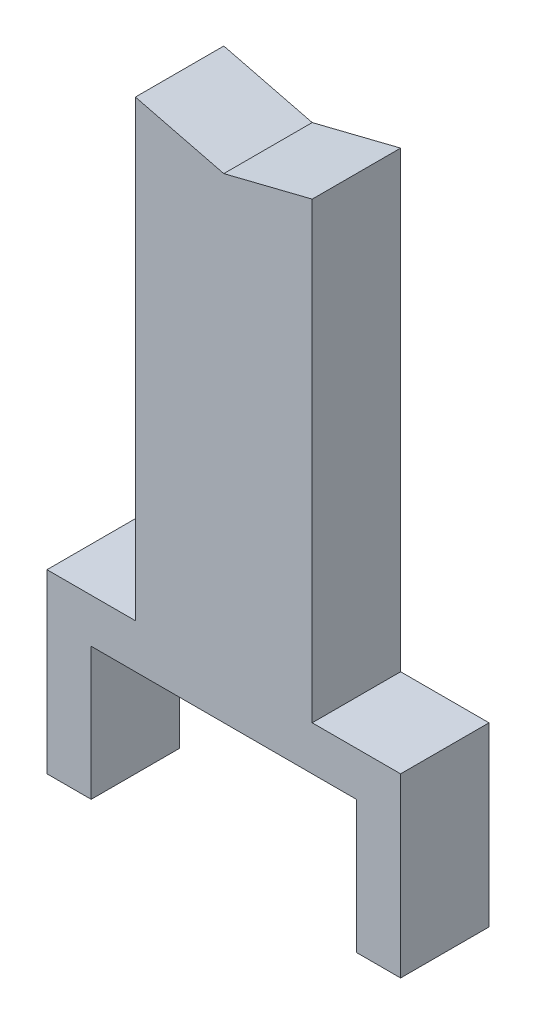
ISO-10303-21;
HEADER;
FILE_DESCRIPTION(('STEP AP214'),'2;1');
FILE_NAME('part.step','',(''),(''),'','','');
FILE_SCHEMA(('AUTOMOTIVE_DESIGN { 1 0 10303 214 1 1 1 1 }'));
ENDSEC;
DATA;
#1=APPLICATION_CONTEXT('core data for automotive mechanical design processes');
#2=APPLICATION_PROTOCOL_DEFINITION('international standard','automotive_design',2000,#1);
#3=PRODUCT_CONTEXT('',#1,'mechanical');
#4=PRODUCT('Part','Part','',(#3));
#5=PRODUCT_RELATED_PRODUCT_CATEGORY('part','',(#4));
#6=PRODUCT_DEFINITION_FORMATION('','',#4);
#7=PRODUCT_DEFINITION_CONTEXT('part definition',#1,'design');
#8=PRODUCT_DEFINITION('design','',#6,#7);
#9=PRODUCT_DEFINITION_SHAPE('','',#8);
#10=(LENGTH_UNIT() NAMED_UNIT(*) SI_UNIT(.MILLI.,.METRE.));
#11=(NAMED_UNIT(*) PLANE_ANGLE_UNIT() SI_UNIT($,.RADIAN.));
#12=(NAMED_UNIT(*) SI_UNIT($,.STERADIAN.) SOLID_ANGLE_UNIT());
#13=UNCERTAINTY_MEASURE_WITH_UNIT(LENGTH_MEASURE(1.E-05),#10,'distance_accuracy_value','');
#14=(GEOMETRIC_REPRESENTATION_CONTEXT(3) GLOBAL_UNCERTAINTY_ASSIGNED_CONTEXT((#13)) GLOBAL_UNIT_ASSIGNED_CONTEXT((#10,
#11,#12)) REPRESENTATION_CONTEXT('',''));
#15=CARTESIAN_POINT('',(0.,0.,0.));
#16=DIRECTION('',(0.,0.,1.));
#17=DIRECTION('',(1.,0.,0.));
#18=AXIS2_PLACEMENT_3D('',#15,#16,#17);
#19=CARTESIAN_POINT('',(0.,76.2,25.4));
#20=DIRECTION('',(0.,1.,0.));
#21=DIRECTION('',(-1.,0.,0.));
#22=AXIS2_PLACEMENT_3D('',#19,#20,#21);
#23=PLANE('',#22);
#24=DIRECTION('',(1.,0.,0.));
#25=VECTOR('',#24,1.);
#26=CARTESIAN_POINT('',(0.,76.2,-25.4));
#27=LINE('',#26,#25);
#28=CARTESIAN_POINT('',(-76.1999999999999,76.2,-25.4));
#29=VERTEX_POINT('',#28);
#30=CARTESIAN_POINT('',(76.2,76.2,-25.4));
#31=VERTEX_POINT('',#30);
#32=EDGE_CURVE('E174',#29,#31,#27,.T.);
#33=ORIENTED_EDGE('',*,*,#32,.T.);
#34=DIRECTION('',(0.,0.,-1.));
#35=VECTOR('',#34,1.);
#36=CARTESIAN_POINT('',(76.2,76.2,25.4));
#37=LINE('',#36,#35);
#38=CARTESIAN_POINT('',(76.2,76.2,25.4));
#39=VERTEX_POINT('',#38);
#40=EDGE_CURVE('E11',#39,#31,#37,.T.);
#41=ORIENTED_EDGE('',*,*,#40,.F.);
#42=DIRECTION('',(1.,0.,0.));
#43=VECTOR('',#42,1.);
#44=CARTESIAN_POINT('',(0.,76.2,25.4));
#45=LINE('',#44,#43);
#46=CARTESIAN_POINT('',(-76.1999999999999,76.2,25.4));
#47=VERTEX_POINT('',#46);
#48=EDGE_CURVE('E113',#47,#39,#45,.T.);
#49=ORIENTED_EDGE('',*,*,#48,.F.);
#50=DIRECTION('',(0.,0.,-1.));
#51=VECTOR('',#50,1.);
#52=CARTESIAN_POINT('',(-76.1999999999999,76.2,25.4));
#53=LINE('',#52,#51);
#54=EDGE_CURVE('E170',#47,#29,#53,.T.);
#55=ORIENTED_EDGE('',*,*,#54,.T.);
#56=EDGE_LOOP('',(#33,#41,#49,#55));
#57=FACE_BOUND('',#56,.T.);
#58=ADVANCED_FACE('F45',(#57),#23,.F.);
#59=CARTESIAN_POINT('',(76.2,0.,25.4));
#60=DIRECTION('',(-1.,0.,0.));
#61=DIRECTION('',(0.,-1.,0.));
#62=AXIS2_PLACEMENT_3D('',#59,#60,#61);
#63=PLANE('',#62);
#64=DIRECTION('',(0.,1.,0.));
#65=VECTOR('',#64,1.);
#66=CARTESIAN_POINT('',(76.2,0.,-25.4));
#67=LINE('',#66,#65);
#68=CARTESIAN_POINT('',(76.2,0.,-25.4));
#69=VERTEX_POINT('',#68);
#70=EDGE_CURVE('E178',#69,#31,#67,.T.);
#71=ORIENTED_EDGE('',*,*,#70,.F.);
#72=DIRECTION('',(0.,0.,-1.));
#73=VECTOR('',#72,1.);
#74=CARTESIAN_POINT('',(76.2,0.,25.4));
#75=LINE('',#74,#73);
#76=CARTESIAN_POINT('',(76.2,0.,25.4));
#77=VERTEX_POINT('',#76);
#78=EDGE_CURVE('E54',#77,#69,#75,.T.);
#79=ORIENTED_EDGE('',*,*,#78,.F.);
#80=DIRECTION('',(0.,1.,0.));
#81=VECTOR('',#80,1.);
#82=CARTESIAN_POINT('',(76.2,0.,25.4));
#83=LINE('',#82,#81);
#84=EDGE_CURVE('E263',#77,#39,#83,.T.);
#85=ORIENTED_EDGE('',*,*,#84,.T.);
#86=ORIENTED_EDGE('',*,*,#40,.T.);
#87=EDGE_LOOP('',(#71,#79,#85,#86));
#88=FACE_BOUND('',#87,.T.);
#89=ADVANCED_FACE('F262',(#88),#63,.T.);
#90=CARTESIAN_POINT('',(0.,0.,25.4));
#91=DIRECTION('',(0.,1.,0.));
#92=DIRECTION('',(-1.,0.,0.));
#93=AXIS2_PLACEMENT_3D('',#90,#91,#92);
#94=PLANE('',#93);
#95=DIRECTION('',(1.,0.,0.));
#96=VECTOR('',#95,1.);
#97=CARTESIAN_POINT('',(0.,0.,-25.4));
#98=LINE('',#97,#96);
#99=CARTESIAN_POINT('',(101.6,0.,-25.4));
#100=VERTEX_POINT('',#99);
#101=EDGE_CURVE('E182',#69,#100,#98,.T.);
#102=ORIENTED_EDGE('',*,*,#101,.T.);
#103=DIRECTION('',(0.,0.,-1.));
#104=VECTOR('',#103,1.);
#105=CARTESIAN_POINT('',(101.6,0.,25.4));
#106=LINE('',#105,#104);
#107=CARTESIAN_POINT('',(101.6,0.,25.4));
#108=VERTEX_POINT('',#107);
#109=EDGE_CURVE('E244',#108,#100,#106,.T.);
#110=ORIENTED_EDGE('',*,*,#109,.F.);
#111=DIRECTION('',(1.,0.,0.));
#112=VECTOR('',#111,1.);
#113=CARTESIAN_POINT('',(0.,0.,25.4));
#114=LINE('',#113,#112);
#115=EDGE_CURVE('E253',#77,#108,#114,.T.);
#116=ORIENTED_EDGE('',*,*,#115,.F.);
#117=ORIENTED_EDGE('',*,*,#78,.T.);
#118=EDGE_LOOP('',(#102,#110,#116,#117));
#119=FACE_BOUND('',#118,.T.);
#120=ADVANCED_FACE('F251',(#119),#94,.F.);
#121=CARTESIAN_POINT('',(101.6,0.,25.4));
#122=DIRECTION('',(-1.,0.,0.));
#123=DIRECTION('',(0.,-1.,0.));
#124=AXIS2_PLACEMENT_3D('',#121,#122,#123);
#125=PLANE('',#124);
#126=DIRECTION('',(0.,1.,0.));
#127=VECTOR('',#126,1.);
#128=CARTESIAN_POINT('',(101.6,0.,-25.4));
#129=LINE('',#128,#127);
#130=CARTESIAN_POINT('',(101.6,101.6,-25.4));
#131=VERTEX_POINT('',#130);
#132=EDGE_CURVE('E185',#100,#131,#129,.T.);
#133=ORIENTED_EDGE('',*,*,#132,.T.);
#134=DIRECTION('',(0.,0.,-1.));
#135=VECTOR('',#134,1.);
#136=CARTESIAN_POINT('',(101.6,101.6,25.4));
#137=LINE('',#136,#135);
#138=CARTESIAN_POINT('',(101.6,101.6,25.4));
#139=VERTEX_POINT('',#138);
#140=EDGE_CURVE('E240',#139,#131,#137,.T.);
#141=ORIENTED_EDGE('',*,*,#140,.F.);
#142=DIRECTION('',(0.,1.,0.));
#143=VECTOR('',#142,1.);
#144=CARTESIAN_POINT('',(101.6,0.,25.4));
#145=LINE('',#144,#143);
#146=EDGE_CURVE('E299',#108,#139,#145,.T.);
#147=ORIENTED_EDGE('',*,*,#146,.F.);
#148=ORIENTED_EDGE('',*,*,#109,.T.);
#149=EDGE_LOOP('',(#133,#141,#147,#148));
#150=FACE_BOUND('',#149,.T.);
#151=ADVANCED_FACE('F298',(#150),#125,.F.);
#152=CARTESIAN_POINT('',(3.88578058618806E-13,101.6,25.4));
#153=DIRECTION('',(0.,-1.,0.));
#154=DIRECTION('',(1.,0.,0.));
#155=AXIS2_PLACEMENT_3D('',#152,#153,#154);
#156=PLANE('',#155);
#157=DIRECTION('',(-1.,0.,0.));
#158=VECTOR('',#157,1.);
#159=CARTESIAN_POINT('',(3.88578058618806E-13,101.6,-25.4));
#160=LINE('',#159,#158);
#161=CARTESIAN_POINT('',(50.7999999999999,101.6,-25.4));
#162=VERTEX_POINT('',#161);
#163=EDGE_CURVE('E188',#131,#162,#160,.T.);
#164=ORIENTED_EDGE('',*,*,#163,.T.);
#165=DIRECTION('',(0.,0.,-1.));
#166=VECTOR('',#165,1.);
#167=CARTESIAN_POINT('',(50.7999999999999,101.6,25.4));
#168=LINE('',#167,#166);
#169=CARTESIAN_POINT('',(50.7999999999999,101.6,25.4));
#170=VERTEX_POINT('',#169);
#171=EDGE_CURVE('E236',#170,#162,#168,.T.);
#172=ORIENTED_EDGE('',*,*,#171,.F.);
#173=DIRECTION('',(-1.,0.,0.));
#174=VECTOR('',#173,1.);
#175=CARTESIAN_POINT('',(3.88578058618806E-13,101.6,25.4));
#176=LINE('',#175,#174);
#177=EDGE_CURVE('E294',#139,#170,#176,.T.);
#178=ORIENTED_EDGE('',*,*,#177,.F.);
#179=ORIENTED_EDGE('',*,*,#140,.T.);
#180=EDGE_LOOP('',(#164,#172,#178,#179));
#181=FACE_BOUND('',#180,.T.);
#182=ADVANCED_FACE('F293',(#181),#156,.F.);
#183=CARTESIAN_POINT('',(50.7999999999999,0.,25.4));
#184=DIRECTION('',(-1.,0.,0.));
#185=DIRECTION('',(0.,-1.,0.));
#186=AXIS2_PLACEMENT_3D('',#183,#184,#185);
#187=PLANE('',#186);
#188=DIRECTION('',(0.,1.,0.));
#189=VECTOR('',#188,1.);
#190=CARTESIAN_POINT('',(50.7999999999999,0.,-25.4));
#191=LINE('',#190,#189);
#192=CARTESIAN_POINT('',(50.8,362.204,-25.4));
#193=VERTEX_POINT('',#192);
#194=EDGE_CURVE('E191',#162,#193,#191,.T.);
#195=ORIENTED_EDGE('',*,*,#194,.T.);
#196=DIRECTION('',(0.,0.,-1.));
#197=VECTOR('',#196,1.);
#198=CARTESIAN_POINT('',(50.8,362.204,25.4));
#199=LINE('',#198,#197);
#200=CARTESIAN_POINT('',(50.8,362.204,25.4));
#201=VERTEX_POINT('',#200);
#202=EDGE_CURVE('E233',#201,#193,#199,.T.);
#203=ORIENTED_EDGE('',*,*,#202,.F.);
#204=DIRECTION('',(0.,1.,0.));
#205=VECTOR('',#204,1.);
#206=CARTESIAN_POINT('',(50.7999999999999,0.,25.4));
#207=LINE('',#206,#205);
#208=EDGE_CURVE('E290',#170,#201,#207,.T.);
#209=ORIENTED_EDGE('',*,*,#208,.F.);
#210=ORIENTED_EDGE('',*,*,#171,.T.);
#211=EDGE_LOOP('',(#195,#203,#209,#210));
#212=FACE_BOUND('',#211,.T.);
#213=ADVANCED_FACE('F288',(#212),#187,.F.);
#214=CARTESIAN_POINT('',(-82.2362352941176,328.944941176471,25.4));
#215=DIRECTION('',(-0.242535625036333,0.970142500145332,0.));
#216=DIRECTION('',(-0.970142500145332,-0.242535625036333,0.));
#217=AXIS2_PLACEMENT_3D('',#214,#215,#216);
#218=PLANE('',#217);
#219=DIRECTION('',(0.970142500145332,0.242535625036333,0.));
#220=VECTOR('',#219,1.);
#221=CARTESIAN_POINT('',(-82.2362352941176,328.944941176471,-25.4));
#222=LINE('',#221,#220);
#223=CARTESIAN_POINT('',(0.,349.504,-25.4));
#224=VERTEX_POINT('',#223);
#225=EDGE_CURVE('E195',#224,#193,#222,.T.);
#226=ORIENTED_EDGE('',*,*,#225,.F.);
#227=DIRECTION('',(0.,0.,-1.));
#228=VECTOR('',#227,1.);
#229=CARTESIAN_POINT('',(0.,349.504,25.4));
#230=LINE('',#229,#228);
#231=CARTESIAN_POINT('',(0.,349.504,25.4));
#232=VERTEX_POINT('',#231);
#233=EDGE_CURVE('E230',#232,#224,#230,.T.);
#234=ORIENTED_EDGE('',*,*,#233,.F.);
#235=DIRECTION('',(0.970142500145332,0.242535625036333,0.));
#236=VECTOR('',#235,1.);
#237=CARTESIAN_POINT('',(-82.2362352941176,328.944941176471,25.4));
#238=LINE('',#237,#236);
#239=EDGE_CURVE('E285',#232,#201,#238,.T.);
#240=ORIENTED_EDGE('',*,*,#239,.T.);
#241=ORIENTED_EDGE('',*,*,#202,.T.);
#242=EDGE_LOOP('',(#226,#234,#240,#241));
#243=FACE_BOUND('',#242,.T.);
#244=ADVANCED_FACE('F281',(#243),#218,.T.);
#245=CARTESIAN_POINT('',(82.2362352941176,328.944941176471,25.4));
#246=DIRECTION('',(0.242535625036333,0.970142500145332,0.));
#247=DIRECTION('',(-0.970142500145332,0.242535625036333,0.));
#248=AXIS2_PLACEMENT_3D('',#245,#246,#247);
#249=PLANE('',#248);
#250=DIRECTION('',(0.970142500145332,-0.242535625036333,0.));
#251=VECTOR('',#250,1.);
#252=CARTESIAN_POINT('',(82.2362352941176,328.944941176471,-25.4));
#253=LINE('',#252,#251);
#254=CARTESIAN_POINT('',(-50.8,362.204,-25.4));
#255=VERTEX_POINT('',#254);
#256=EDGE_CURVE('E199',#255,#224,#253,.T.);
#257=ORIENTED_EDGE('',*,*,#256,.F.);
#258=DIRECTION('',(0.,0.,-1.));
#259=VECTOR('',#258,1.);
#260=CARTESIAN_POINT('',(-50.8,362.204,25.4));
#261=LINE('',#260,#259);
#262=CARTESIAN_POINT('',(-50.8,362.204,25.4));
#263=VERTEX_POINT('',#262);
#264=EDGE_CURVE('E227',#263,#255,#261,.T.);
#265=ORIENTED_EDGE('',*,*,#264,.F.);
#266=DIRECTION('',(0.970142500145332,-0.242535625036333,0.));
#267=VECTOR('',#266,1.);
#268=CARTESIAN_POINT('',(82.2362352941176,328.944941176471,25.4));
#269=LINE('',#268,#267);
#270=EDGE_CURVE('E312',#263,#232,#269,.T.);
#271=ORIENTED_EDGE('',*,*,#270,.T.);
#272=ORIENTED_EDGE('',*,*,#233,.T.);
#273=EDGE_LOOP('',(#257,#265,#271,#272));
#274=FACE_BOUND('',#273,.T.);
#275=ADVANCED_FACE('F277',(#274),#249,.T.);
#276=CARTESIAN_POINT('',(-50.7999999999999,0.,25.4));
#277=DIRECTION('',(-1.,0.,0.));
#278=DIRECTION('',(0.,-1.,0.));
#279=AXIS2_PLACEMENT_3D('',#276,#277,#278);
#280=PLANE('',#279);
#281=DIRECTION('',(0.,1.,0.));
#282=VECTOR('',#281,1.);
#283=CARTESIAN_POINT('',(-50.7999999999999,0.,-25.4));
#284=LINE('',#283,#282);
#285=CARTESIAN_POINT('',(-50.7999999999999,101.6,-25.4));
#286=VERTEX_POINT('',#285);
#287=EDGE_CURVE('E203',#286,#255,#284,.T.);
#288=ORIENTED_EDGE('',*,*,#287,.F.);
#289=DIRECTION('',(0.,0.,-1.));
#290=VECTOR('',#289,1.);
#291=CARTESIAN_POINT('',(-50.7999999999999,101.6,25.4));
#292=LINE('',#291,#290);
#293=CARTESIAN_POINT('',(-50.7999999999999,101.6,25.4));
#294=VERTEX_POINT('',#293);
#295=EDGE_CURVE('E224',#294,#286,#292,.T.);
#296=ORIENTED_EDGE('',*,*,#295,.F.);
#297=DIRECTION('',(0.,1.,0.));
#298=VECTOR('',#297,1.);
#299=CARTESIAN_POINT('',(-50.7999999999999,0.,25.4));
#300=LINE('',#299,#298);
#301=EDGE_CURVE('E273',#294,#263,#300,.T.);
#302=ORIENTED_EDGE('',*,*,#301,.T.);
#303=ORIENTED_EDGE('',*,*,#264,.T.);
#304=EDGE_LOOP('',(#288,#296,#302,#303));
#305=FACE_BOUND('',#304,.T.);
#306=ADVANCED_FACE('F271',(#305),#280,.T.);
#307=CARTESIAN_POINT('',(0.,101.6,25.4));
#308=DIRECTION('',(0.,1.,0.));
#309=DIRECTION('',(0.,0.,1.));
#310=AXIS2_PLACEMENT_3D('',#307,#308,#309);
#311=PLANE('',#310);
#312=DIRECTION('',(1.,0.,0.));
#313=VECTOR('',#312,1.);
#314=CARTESIAN_POINT('',(0.,101.6,-25.4));
#315=LINE('',#314,#313);
#316=CARTESIAN_POINT('',(-101.6,101.6,-25.4));
#317=VERTEX_POINT('',#316);
#318=EDGE_CURVE('E207',#317,#286,#315,.T.);
#319=ORIENTED_EDGE('',*,*,#318,.F.);
#320=DIRECTION('',(0.,0.,-1.));
#321=VECTOR('',#320,1.);
#322=CARTESIAN_POINT('',(-101.6,101.6,25.4));
#323=LINE('',#322,#321);
#324=CARTESIAN_POINT('',(-101.6,101.6,25.4));
#325=VERTEX_POINT('',#324);
#326=EDGE_CURVE('E156',#325,#317,#323,.T.);
#327=ORIENTED_EDGE('',*,*,#326,.F.);
#328=DIRECTION('',(1.,0.,0.));
#329=VECTOR('',#328,1.);
#330=CARTESIAN_POINT('',(0.,101.6,25.4));
#331=LINE('',#330,#329);
#332=EDGE_CURVE('E163',#325,#294,#331,.T.);
#333=ORIENTED_EDGE('',*,*,#332,.T.);
#334=ORIENTED_EDGE('',*,*,#295,.T.);
#335=EDGE_LOOP('',(#319,#327,#333,#334));
#336=FACE_BOUND('',#335,.T.);
#337=ADVANCED_FACE('F268',(#336),#311,.T.);
#338=CARTESIAN_POINT('',(-101.6,0.,25.4));
#339=DIRECTION('',(-1.,0.,0.));
#340=DIRECTION('',(0.,0.,1.));
#341=AXIS2_PLACEMENT_3D('',#338,#339,#340);
#342=PLANE('',#341);
#343=DIRECTION('',(0.,1.,0.));
#344=VECTOR('',#343,1.);
#345=CARTESIAN_POINT('',(-101.6,0.,-25.4));
#346=LINE('',#345,#344);
#347=CARTESIAN_POINT('',(-101.6,0.,-25.4));
#348=VERTEX_POINT('',#347);
#349=EDGE_CURVE('E150',#348,#317,#346,.T.);
#350=ORIENTED_EDGE('',*,*,#349,.F.);
#351=DIRECTION('',(0.,0.,-1.));
#352=VECTOR('',#351,1.);
#353=CARTESIAN_POINT('',(-101.6,0.,25.4));
#354=LINE('',#353,#352);
#355=CARTESIAN_POINT('',(-101.6,0.,25.4));
#356=VERTEX_POINT('',#355);
#357=EDGE_CURVE('E145',#356,#348,#354,.T.);
#358=ORIENTED_EDGE('',*,*,#357,.F.);
#359=DIRECTION('',(0.,1.,0.));
#360=VECTOR('',#359,1.);
#361=CARTESIAN_POINT('',(-101.6,0.,25.4));
#362=LINE('',#361,#360);
#363=EDGE_CURVE('E148',#356,#325,#362,.T.);
#364=ORIENTED_EDGE('',*,*,#363,.T.);
#365=ORIENTED_EDGE('',*,*,#326,.T.);
#366=EDGE_LOOP('',(#350,#358,#364,#365));
#367=FACE_BOUND('',#366,.T.);
#368=ADVANCED_FACE('F147',(#367),#342,.T.);
#369=CARTESIAN_POINT('',(0.,0.,25.4));
#370=DIRECTION('',(0.,-1.,0.));
#371=DIRECTION('',(1.,0.,0.));
#372=AXIS2_PLACEMENT_3D('',#369,#370,#371);
#373=PLANE('',#372);
#374=DIRECTION('',(-1.,0.,0.));
#375=VECTOR('',#374,1.);
#376=CARTESIAN_POINT('',(0.,0.,-25.4));
#377=LINE('',#376,#375);
#378=CARTESIAN_POINT('',(-76.1999999999999,0.,-25.4));
#379=VERTEX_POINT('',#378);
#380=EDGE_CURVE('E213',#379,#348,#377,.T.);
#381=ORIENTED_EDGE('',*,*,#380,.F.);
#382=DIRECTION('',(0.,0.,-1.));
#383=VECTOR('',#382,1.);
#384=CARTESIAN_POINT('',(-76.1999999999999,0.,25.4));
#385=LINE('',#384,#383);
#386=CARTESIAN_POINT('',(-76.1999999999999,0.,25.4));
#387=VERTEX_POINT('',#386);
#388=EDGE_CURVE('E104',#387,#379,#385,.T.);
#389=ORIENTED_EDGE('',*,*,#388,.F.);
#390=DIRECTION('',(-1.,0.,0.));
#391=VECTOR('',#390,1.);
#392=CARTESIAN_POINT('',(0.,0.,25.4));
#393=LINE('',#392,#391);
#394=EDGE_CURVE('E160',#387,#356,#393,.T.);
#395=ORIENTED_EDGE('',*,*,#394,.T.);
#396=ORIENTED_EDGE('',*,*,#357,.T.);
#397=EDGE_LOOP('',(#381,#389,#395,#396));
#398=FACE_BOUND('',#397,.T.);
#399=ADVANCED_FACE('F166',(#398),#373,.T.);
#400=CARTESIAN_POINT('',(-76.1999999999999,0.,25.4));
#401=DIRECTION('',(-1.,0.,0.));
#402=DIRECTION('',(0.,-1.,0.));
#403=AXIS2_PLACEMENT_3D('',#400,#401,#402);
#404=PLANE('',#403);
#405=DIRECTION('',(0.,1.,0.));
#406=VECTOR('',#405,1.);
#407=CARTESIAN_POINT('',(-76.1999999999999,0.,-25.4));
#408=LINE('',#407,#406);
#409=EDGE_CURVE('E107',#379,#29,#408,.T.);
#410=ORIENTED_EDGE('',*,*,#409,.T.);
#411=ORIENTED_EDGE('',*,*,#54,.F.);
#412=DIRECTION('',(0.,1.,0.));
#413=VECTOR('',#412,1.);
#414=CARTESIAN_POINT('',(-76.1999999999999,0.,25.4));
#415=LINE('',#414,#413);
#416=EDGE_CURVE('E62',#387,#47,#415,.T.);
#417=ORIENTED_EDGE('',*,*,#416,.F.);
#418=ORIENTED_EDGE('',*,*,#388,.T.);
#419=EDGE_LOOP('',(#410,#411,#417,#418));
#420=FACE_BOUND('',#419,.T.);
#421=ADVANCED_FACE('F414',(#420),#404,.F.);
#422=CARTESIAN_POINT('',(0.,0.,25.4));
#423=DIRECTION('',(0.,0.,1.));
#424=DIRECTION('',(1.,0.,0.));
#425=AXIS2_PLACEMENT_3D('',#422,#423,#424);
#426=PLANE('',#425);
#427=ORIENTED_EDGE('',*,*,#48,.T.);
#428=ORIENTED_EDGE('',*,*,#84,.F.);
#429=ORIENTED_EDGE('',*,*,#115,.T.);
#430=ORIENTED_EDGE('',*,*,#146,.T.);
#431=ORIENTED_EDGE('',*,*,#177,.T.);
#432=ORIENTED_EDGE('',*,*,#208,.T.);
#433=ORIENTED_EDGE('',*,*,#239,.F.);
#434=ORIENTED_EDGE('',*,*,#270,.F.);
#435=ORIENTED_EDGE('',*,*,#301,.F.);
#436=ORIENTED_EDGE('',*,*,#332,.F.);
#437=ORIENTED_EDGE('',*,*,#363,.F.);
#438=ORIENTED_EDGE('',*,*,#394,.F.);
#439=ORIENTED_EDGE('',*,*,#416,.T.);
#440=EDGE_LOOP('',(#427,#428,#429,#430,#431,#432,#433,#434,#435,#436,#437,#438,#439));
#441=FACE_BOUND('',#440,.T.);
#442=ADVANCED_FACE('F159',(#441),#426,.T.);
#443=CARTESIAN_POINT('',(0.,0.,-25.4));
#444=DIRECTION('',(0.,0.,1.));
#445=DIRECTION('',(1.,0.,0.));
#446=AXIS2_PLACEMENT_3D('',#443,#444,#445);
#447=PLANE('',#446);
#448=ORIENTED_EDGE('',*,*,#32,.F.);
#449=ORIENTED_EDGE('',*,*,#409,.F.);
#450=ORIENTED_EDGE('',*,*,#380,.T.);
#451=ORIENTED_EDGE('',*,*,#349,.T.);
#452=ORIENTED_EDGE('',*,*,#318,.T.);
#453=ORIENTED_EDGE('',*,*,#287,.T.);
#454=ORIENTED_EDGE('',*,*,#256,.T.);
#455=ORIENTED_EDGE('',*,*,#225,.T.);
#456=ORIENTED_EDGE('',*,*,#194,.F.);
#457=ORIENTED_EDGE('',*,*,#163,.F.);
#458=ORIENTED_EDGE('',*,*,#132,.F.);
#459=ORIENTED_EDGE('',*,*,#101,.F.);
#460=ORIENTED_EDGE('',*,*,#70,.T.);
#461=EDGE_LOOP('',(#448,#449,#450,#451,#452,#453,#454,#455,#456,#457,#458,#459,#460));
#462=FACE_BOUND('',#461,.T.);
#463=ADVANCED_FACE('F260',(#462),#447,.F.);
#464=CLOSED_SHELL('',(#58,#89,#120,#151,#182,#213,#244,#275,#306,#337,#368,#399,#421,#442,#463));
#465=MANIFOLD_SOLID_BREP('B2',#464);
#466=ADVANCED_BREP_SHAPE_REPRESENTATION('',(#18,#465),#14);
#467=SHAPE_DEFINITION_REPRESENTATION(#9,#466);
ENDSEC;
END-ISO-10303-21;
